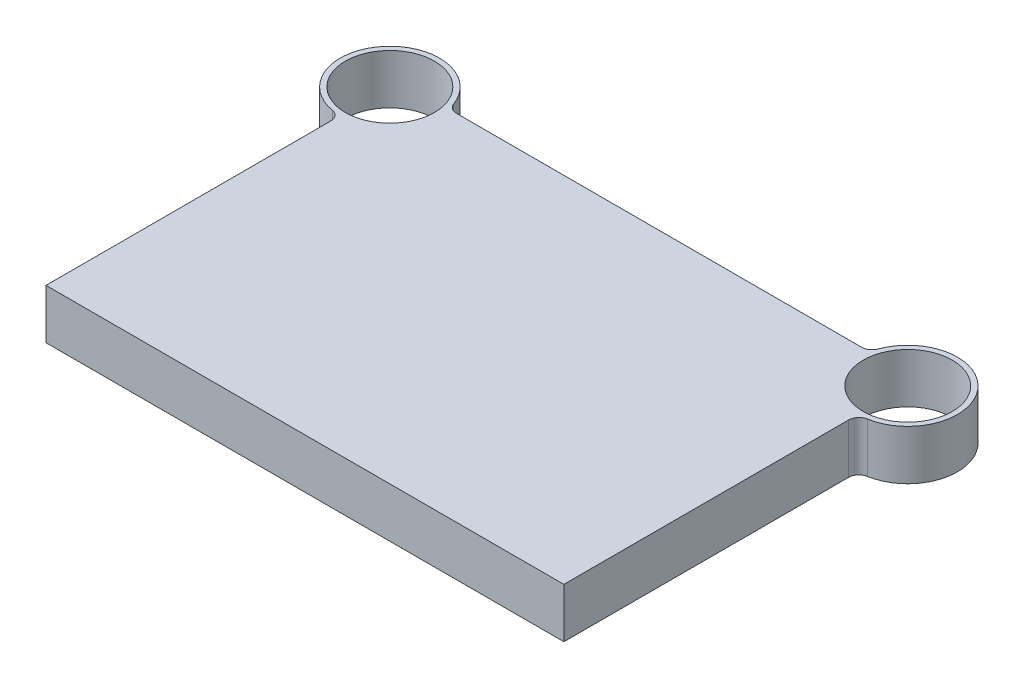
ISO-10303-21;
HEADER;
FILE_DESCRIPTION(('STEP AP214'),'2;1');
FILE_NAME('part.step','',(''),(''),'','','');
FILE_SCHEMA(('AUTOMOTIVE_DESIGN { 1 0 10303 214 1 1 1 1 }'));
ENDSEC;
DATA;
#1=APPLICATION_CONTEXT('core data for automotive mechanical design processes');
#2=APPLICATION_PROTOCOL_DEFINITION('international standard','automotive_design',2000,#1);
#3=PRODUCT_CONTEXT('',#1,'mechanical');
#4=PRODUCT('Part','Part','',(#3));
#5=PRODUCT_RELATED_PRODUCT_CATEGORY('part','',(#4));
#6=PRODUCT_DEFINITION_FORMATION('','',#4);
#7=PRODUCT_DEFINITION_CONTEXT('part definition',#1,'design');
#8=PRODUCT_DEFINITION('design','',#6,#7);
#9=PRODUCT_DEFINITION_SHAPE('','',#8);
#10=(LENGTH_UNIT() NAMED_UNIT(*) SI_UNIT(.MILLI.,.METRE.));
#11=(NAMED_UNIT(*) PLANE_ANGLE_UNIT() SI_UNIT($,.RADIAN.));
#12=(NAMED_UNIT(*) SI_UNIT($,.STERADIAN.) SOLID_ANGLE_UNIT());
#13=UNCERTAINTY_MEASURE_WITH_UNIT(LENGTH_MEASURE(1.E-05),#10,'distance_accuracy_value','');
#14=(GEOMETRIC_REPRESENTATION_CONTEXT(3) GLOBAL_UNCERTAINTY_ASSIGNED_CONTEXT((#13)) GLOBAL_UNIT_ASSIGNED_CONTEXT((#10,
#11,#12)) REPRESENTATION_CONTEXT('',''));
#15=CARTESIAN_POINT('',(0.,0.,0.));
#16=DIRECTION('',(0.,0.,1.));
#17=DIRECTION('',(1.,0.,0.));
#18=AXIS2_PLACEMENT_3D('',#15,#16,#17);
#19=CARTESIAN_POINT('',(-250.,48.,-332.));
#20=DIRECTION('',(0.,1.,0.));
#21=DIRECTION('',(0.,0.,1.));
#22=AXIS2_PLACEMENT_3D('',#19,#20,#21);
#23=PLANE('',#22);
#24=CARTESIAN_POINT('',(-250.,48.,-332.));
#25=DIRECTION('',(0.,1.,0.));
#26=DIRECTION('',(0.,0.,1.));
#27=AXIS2_PLACEMENT_3D('',#24,#25,#26);
#28=CIRCLE('',#27,43.);
#29=CARTESIAN_POINT('',(-250.,48.,-289.));
#30=VERTEX_POINT('',#29);
#31=EDGE_CURVE('E209',#30,#30,#28,.T.);
#32=ORIENTED_EDGE('',*,*,#31,.F.);
#33=EDGE_LOOP('',(#32));
#34=FACE_BOUND('',#33,.T.);
#35=CARTESIAN_POINT('',(-250.,48.,-332.));
#36=DIRECTION('',(0.,1.,0.));
#37=DIRECTION('',(0.,0.,1.));
#38=AXIS2_PLACEMENT_3D('',#35,#36,#37);
#39=CIRCLE('',#38,48.);
#40=CARTESIAN_POINT('',(-204.944030050815,48.,-348.551724137931));
#41=VERTEX_POINT('',#40);
#42=CARTESIAN_POINT('',(-258.275862068966,48.,-284.718818679992));
#43=VERTEX_POINT('',#42);
#44=EDGE_CURVE('E139',#41,#43,#39,.T.);
#45=ORIENTED_EDGE('',*,*,#44,.T.);
#46=CARTESIAN_POINT('',(-260.,48.,-274.868572571657));
#47=DIRECTION('',(0.,1.,0.));
#48=DIRECTION('',(0.,0.,1.));
#49=AXIS2_PLACEMENT_3D('',#46,#47,#48);
#50=CIRCLE('',#49,10.);
#51=CARTESIAN_POINT('',(-250.,48.,-274.868572571657));
#52=VERTEX_POINT('',#51);
#53=EDGE_CURVE('E116',#43,#52,#50,.F.);
#54=ORIENTED_EDGE('',*,*,#53,.T.);
#55=DIRECTION('',(0.,0.,1.));
#56=VECTOR('',#55,1.);
#57=CARTESIAN_POINT('',(-250.,48.,0.));
#58=LINE('',#57,#56);
#59=CARTESIAN_POINT('',(-250.,48.,0.));
#60=VERTEX_POINT('',#59);
#61=EDGE_CURVE('E109',#52,#60,#58,.T.);
#62=ORIENTED_EDGE('',*,*,#61,.T.);
#63=DIRECTION('',(1.,0.,0.));
#64=VECTOR('',#63,1.);
#65=CARTESIAN_POINT('',(250.,48.,0.));
#66=LINE('',#65,#64);
#67=CARTESIAN_POINT('',(250.,48.,0.));
#68=VERTEX_POINT('',#67);
#69=EDGE_CURVE('E113',#60,#68,#66,.T.);
#70=ORIENTED_EDGE('',*,*,#69,.T.);
#71=DIRECTION('',(0.,0.,-1.));
#72=VECTOR('',#71,1.);
#73=CARTESIAN_POINT('',(250.,48.,0.));
#74=LINE('',#73,#72);
#75=CARTESIAN_POINT('',(250.,48.,-274.868572571657));
#76=VERTEX_POINT('',#75);
#77=EDGE_CURVE('E129',#68,#76,#74,.T.);
#78=ORIENTED_EDGE('',*,*,#77,.T.);
#79=CARTESIAN_POINT('',(260.,48.,-274.868572571657));
#80=DIRECTION('',(0.,1.,0.));
#81=DIRECTION('',(0.,0.,1.));
#82=AXIS2_PLACEMENT_3D('',#79,#80,#81);
#83=CIRCLE('',#82,10.);
#84=CARTESIAN_POINT('',(258.275862068966,48.,-284.718818679992));
#85=VERTEX_POINT('',#84);
#86=EDGE_CURVE('E11',#76,#85,#83,.F.);
#87=ORIENTED_EDGE('',*,*,#86,.T.);
#88=CARTESIAN_POINT('',(250.,48.,-332.));
#89=DIRECTION('',(0.,1.,0.));
#90=DIRECTION('',(0.,0.,-1.));
#91=AXIS2_PLACEMENT_3D('',#88,#89,#90);
#92=CIRCLE('',#91,48.);
#93=CARTESIAN_POINT('',(204.944030050815,48.,-348.551724137931));
#94=VERTEX_POINT('',#93);
#95=EDGE_CURVE('E175',#85,#94,#92,.T.);
#96=ORIENTED_EDGE('',*,*,#95,.T.);
#97=CARTESIAN_POINT('',(195.557369644735,48.,-352.));
#98=DIRECTION('',(0.,1.,0.));
#99=DIRECTION('',(0.,0.,1.));
#100=AXIS2_PLACEMENT_3D('',#97,#98,#99);
#101=CIRCLE('',#100,10.);
#102=CARTESIAN_POINT('',(195.557369644735,48.,-342.));
#103=VERTEX_POINT('',#102);
#104=EDGE_CURVE('E167',#94,#103,#101,.F.);
#105=ORIENTED_EDGE('',*,*,#104,.T.);
#106=DIRECTION('',(-1.,0.,0.));
#107=VECTOR('',#106,1.);
#108=CARTESIAN_POINT('',(203.053221622778,48.,-342.));
#109=LINE('',#108,#107);
#110=CARTESIAN_POINT('',(-195.557369644735,48.,-342.));
#111=VERTEX_POINT('',#110);
#112=EDGE_CURVE('E172',#103,#111,#109,.T.);
#113=ORIENTED_EDGE('',*,*,#112,.T.);
#114=CARTESIAN_POINT('',(-195.557369644735,48.,-352.));
#115=DIRECTION('',(0.,1.,0.));
#116=DIRECTION('',(0.,0.,1.));
#117=AXIS2_PLACEMENT_3D('',#114,#115,#116);
#118=CIRCLE('',#117,10.);
#119=EDGE_CURVE('E163',#111,#41,#118,.F.);
#120=ORIENTED_EDGE('',*,*,#119,.T.);
#121=EDGE_LOOP('',(#45,#54,#62,#70,#78,#87,#96,#105,#113,#120));
#122=FACE_BOUND('',#121,.T.);
#123=CARTESIAN_POINT('',(250.,48.,-332.));
#124=DIRECTION('',(0.,1.,0.));
#125=DIRECTION('',(0.,0.,-1.));
#126=AXIS2_PLACEMENT_3D('',#123,#124,#125);
#127=CIRCLE('',#126,43.);
#128=CARTESIAN_POINT('',(250.,48.,-375.));
#129=VERTEX_POINT('',#128);
#130=EDGE_CURVE('E219',#129,#129,#127,.T.);
#131=ORIENTED_EDGE('',*,*,#130,.F.);
#132=EDGE_LOOP('',(#131));
#133=FACE_BOUND('',#132,.T.);
#134=ADVANCED_FACE('F33',(#34,#122,#133),#23,.T.);
#135=CARTESIAN_POINT('',(-250.,0.,-332.));
#136=DIRECTION('',(0.,1.,0.));
#137=DIRECTION('',(0.,0.,1.));
#138=AXIS2_PLACEMENT_3D('',#135,#136,#137);
#139=PLANE('',#138);
#140=DIRECTION('',(0.,0.,1.));
#141=VECTOR('',#140,1.);
#142=CARTESIAN_POINT('',(-250.,0.,0.));
#143=LINE('',#142,#141);
#144=CARTESIAN_POINT('',(-250.,0.,-274.868572571657));
#145=VERTEX_POINT('',#144);
#146=CARTESIAN_POINT('',(-250.,0.,0.));
#147=VERTEX_POINT('',#146);
#148=EDGE_CURVE('E133',#145,#147,#143,.T.);
#149=ORIENTED_EDGE('',*,*,#148,.F.);
#150=CARTESIAN_POINT('',(-260.,0.,-274.868572571657));
#151=DIRECTION('',(0.,1.,0.));
#152=DIRECTION('',(0.,0.,1.));
#153=AXIS2_PLACEMENT_3D('',#150,#151,#152);
#154=CIRCLE('',#153,10.);
#155=CARTESIAN_POINT('',(-258.275862068966,0.,-284.718818679992));
#156=VERTEX_POINT('',#155);
#157=EDGE_CURVE('E158',#145,#156,#154,.T.);
#158=ORIENTED_EDGE('',*,*,#157,.T.);
#159=CARTESIAN_POINT('',(-250.,0.,-332.));
#160=DIRECTION('',(0.,1.,0.));
#161=DIRECTION('',(0.,0.,1.));
#162=AXIS2_PLACEMENT_3D('',#159,#160,#161);
#163=CIRCLE('',#162,48.);
#164=CARTESIAN_POINT('',(-204.944030050815,0.,-348.551724137931));
#165=VERTEX_POINT('',#164);
#166=EDGE_CURVE('E121',#165,#156,#163,.T.);
#167=ORIENTED_EDGE('',*,*,#166,.F.);
#168=CARTESIAN_POINT('',(-195.557369644735,0.,-352.));
#169=DIRECTION('',(0.,1.,0.));
#170=DIRECTION('',(0.,0.,1.));
#171=AXIS2_PLACEMENT_3D('',#168,#169,#170);
#172=CIRCLE('',#171,10.);
#173=CARTESIAN_POINT('',(-195.557369644735,0.,-342.));
#174=VERTEX_POINT('',#173);
#175=EDGE_CURVE('E161',#165,#174,#172,.T.);
#176=ORIENTED_EDGE('',*,*,#175,.T.);
#177=DIRECTION('',(-1.,0.,0.));
#178=VECTOR('',#177,1.);
#179=CARTESIAN_POINT('',(203.053221622778,0.,-342.));
#180=LINE('',#179,#178);
#181=CARTESIAN_POINT('',(195.557369644735,0.,-342.));
#182=VERTEX_POINT('',#181);
#183=EDGE_CURVE('E190',#182,#174,#180,.T.);
#184=ORIENTED_EDGE('',*,*,#183,.F.);
#185=CARTESIAN_POINT('',(195.557369644735,0.,-352.));
#186=DIRECTION('',(0.,1.,0.));
#187=DIRECTION('',(0.,0.,1.));
#188=AXIS2_PLACEMENT_3D('',#185,#186,#187);
#189=CIRCLE('',#188,10.);
#190=CARTESIAN_POINT('',(204.944030050815,0.,-348.551724137931));
#191=VERTEX_POINT('',#190);
#192=EDGE_CURVE('E165',#182,#191,#189,.T.);
#193=ORIENTED_EDGE('',*,*,#192,.T.);
#194=CARTESIAN_POINT('',(250.,0.,-332.));
#195=DIRECTION('',(0.,1.,0.));
#196=DIRECTION('',(0.,0.,-1.));
#197=AXIS2_PLACEMENT_3D('',#194,#195,#196);
#198=CIRCLE('',#197,48.);
#199=CARTESIAN_POINT('',(258.275862068966,0.,-284.718818679992));
#200=VERTEX_POINT('',#199);
#201=EDGE_CURVE('E189',#200,#191,#198,.T.);
#202=ORIENTED_EDGE('',*,*,#201,.F.);
#203=CARTESIAN_POINT('',(260.,0.,-274.868572571657));
#204=DIRECTION('',(0.,1.,0.));
#205=DIRECTION('',(0.,0.,1.));
#206=AXIS2_PLACEMENT_3D('',#203,#204,#205);
#207=CIRCLE('',#206,10.);
#208=CARTESIAN_POINT('',(250.,0.,-274.868572571657));
#209=VERTEX_POINT('',#208);
#210=EDGE_CURVE('E41',#200,#209,#207,.T.);
#211=ORIENTED_EDGE('',*,*,#210,.T.);
#212=DIRECTION('',(0.,0.,-1.));
#213=VECTOR('',#212,1.);
#214=CARTESIAN_POINT('',(250.,0.,0.));
#215=LINE('',#214,#213);
#216=CARTESIAN_POINT('',(250.,0.,0.));
#217=VERTEX_POINT('',#216);
#218=EDGE_CURVE('E194',#217,#209,#215,.T.);
#219=ORIENTED_EDGE('',*,*,#218,.F.);
#220=DIRECTION('',(1.,0.,0.));
#221=VECTOR('',#220,1.);
#222=CARTESIAN_POINT('',(250.,0.,0.));
#223=LINE('',#222,#221);
#224=EDGE_CURVE('E197',#147,#217,#223,.T.);
#225=ORIENTED_EDGE('',*,*,#224,.F.);
#226=EDGE_LOOP('',(#149,#158,#167,#176,#184,#193,#202,#211,#219,#225));
#227=FACE_BOUND('',#226,.T.);
#228=CARTESIAN_POINT('',(-250.,0.,-332.));
#229=DIRECTION('',(0.,1.,0.));
#230=DIRECTION('',(0.,0.,1.));
#231=AXIS2_PLACEMENT_3D('',#228,#229,#230);
#232=CIRCLE('',#231,43.);
#233=CARTESIAN_POINT('',(-250.,0.,-289.));
#234=VERTEX_POINT('',#233);
#235=EDGE_CURVE('E212',#234,#234,#232,.T.);
#236=ORIENTED_EDGE('',*,*,#235,.T.);
#237=EDGE_LOOP('',(#236));
#238=FACE_BOUND('',#237,.T.);
#239=CARTESIAN_POINT('',(250.,0.,-332.));
#240=DIRECTION('',(0.,1.,0.));
#241=DIRECTION('',(0.,0.,-1.));
#242=AXIS2_PLACEMENT_3D('',#239,#240,#241);
#243=CIRCLE('',#242,43.);
#244=CARTESIAN_POINT('',(250.,0.,-375.));
#245=VERTEX_POINT('',#244);
#246=EDGE_CURVE('E221',#245,#245,#243,.T.);
#247=ORIENTED_EDGE('',*,*,#246,.T.);
#248=EDGE_LOOP('',(#247));
#249=FACE_BOUND('',#248,.T.);
#250=ADVANCED_FACE('F187',(#227,#238,#249),#139,.F.);
#251=CARTESIAN_POINT('',(-250.,48.,0.));
#252=DIRECTION('',(1.,0.,0.));
#253=DIRECTION('',(0.,0.,-1.));
#254=AXIS2_PLACEMENT_3D('',#251,#252,#253);
#255=PLANE('',#254);
#256=ORIENTED_EDGE('',*,*,#61,.F.);
#257=DIRECTION('',(0.,1.,0.));
#258=VECTOR('',#257,1.);
#259=CARTESIAN_POINT('',(-250.,0.,-274.868572571657));
#260=LINE('',#259,#258);
#261=EDGE_CURVE('E135',#52,#145,#260,.F.);
#262=ORIENTED_EDGE('',*,*,#261,.T.);
#263=ORIENTED_EDGE('',*,*,#148,.T.);
#264=DIRECTION('',(0.,-1.,0.));
#265=VECTOR('',#264,1.);
#266=CARTESIAN_POINT('',(-250.,48.,0.));
#267=LINE('',#266,#265);
#268=EDGE_CURVE('E126',#60,#147,#267,.T.);
#269=ORIENTED_EDGE('',*,*,#268,.F.);
#270=EDGE_LOOP('',(#256,#262,#263,#269));
#271=FACE_BOUND('',#270,.T.);
#272=ADVANCED_FACE('F131',(#271),#255,.F.);
#273=CARTESIAN_POINT('',(250.,48.,0.));
#274=DIRECTION('',(0.,0.,-1.));
#275=DIRECTION('',(-1.,0.,0.));
#276=AXIS2_PLACEMENT_3D('',#273,#274,#275);
#277=PLANE('',#276);
#278=ORIENTED_EDGE('',*,*,#224,.T.);
#279=DIRECTION('',(0.,-1.,0.));
#280=VECTOR('',#279,1.);
#281=CARTESIAN_POINT('',(250.,48.,0.));
#282=LINE('',#281,#280);
#283=EDGE_CURVE('E128',#68,#217,#282,.T.);
#284=ORIENTED_EDGE('',*,*,#283,.F.);
#285=ORIENTED_EDGE('',*,*,#69,.F.);
#286=ORIENTED_EDGE('',*,*,#268,.T.);
#287=EDGE_LOOP('',(#278,#284,#285,#286));
#288=FACE_BOUND('',#287,.T.);
#289=ADVANCED_FACE('F125',(#288),#277,.F.);
#290=CARTESIAN_POINT('',(250.,48.,0.));
#291=DIRECTION('',(-1.,0.,0.));
#292=DIRECTION('',(0.,0.,1.));
#293=AXIS2_PLACEMENT_3D('',#290,#291,#292);
#294=PLANE('',#293);
#295=ORIENTED_EDGE('',*,*,#218,.T.);
#296=DIRECTION('',(0.,1.,0.));
#297=VECTOR('',#296,1.);
#298=CARTESIAN_POINT('',(250.,48.,-274.868572571657));
#299=LINE('',#298,#297);
#300=EDGE_CURVE('E48',#209,#76,#299,.T.);
#301=ORIENTED_EDGE('',*,*,#300,.T.);
#302=ORIENTED_EDGE('',*,*,#77,.F.);
#303=ORIENTED_EDGE('',*,*,#283,.T.);
#304=EDGE_LOOP('',(#295,#301,#302,#303));
#305=FACE_BOUND('',#304,.T.);
#306=ADVANCED_FACE('F247',(#305),#294,.F.);
#307=CARTESIAN_POINT('',(250.,48.,-332.));
#308=DIRECTION('',(0.,-1.,0.));
#309=DIRECTION('',(0.,0.,-1.));
#310=AXIS2_PLACEMENT_3D('',#307,#308,#309);
#311=CYLINDRICAL_SURFACE('',#310,48.);
#312=ORIENTED_EDGE('',*,*,#201,.T.);
#313=DIRECTION('',(0.,-1.,0.));
#314=VECTOR('',#313,1.);
#315=CARTESIAN_POINT('',(204.944030050815,48.,-348.551724137931));
#316=LINE('',#315,#314);
#317=EDGE_CURVE('E155',#191,#94,#316,.F.);
#318=ORIENTED_EDGE('',*,*,#317,.T.);
#319=ORIENTED_EDGE('',*,*,#95,.F.);
#320=DIRECTION('',(0.,-1.,0.));
#321=VECTOR('',#320,1.);
#322=CARTESIAN_POINT('',(258.275862068966,48.,-284.718818679992));
#323=LINE('',#322,#321);
#324=EDGE_CURVE('E152',#85,#200,#323,.T.);
#325=ORIENTED_EDGE('',*,*,#324,.T.);
#326=EDGE_LOOP('',(#312,#318,#319,#325));
#327=FACE_BOUND('',#326,.T.);
#328=ADVANCED_FACE('F192',(#327),#311,.T.);
#329=CARTESIAN_POINT('',(203.053221622778,48.,-342.));
#330=DIRECTION('',(0.,0.,1.));
#331=DIRECTION('',(1.,0.,0.));
#332=AXIS2_PLACEMENT_3D('',#329,#330,#331);
#333=PLANE('',#332);
#334=ORIENTED_EDGE('',*,*,#183,.T.);
#335=DIRECTION('',(0.,1.,0.));
#336=VECTOR('',#335,1.);
#337=CARTESIAN_POINT('',(-195.557369644735,48.,-342.));
#338=LINE('',#337,#336);
#339=EDGE_CURVE('E150',#174,#111,#338,.T.);
#340=ORIENTED_EDGE('',*,*,#339,.T.);
#341=ORIENTED_EDGE('',*,*,#112,.F.);
#342=DIRECTION('',(0.,1.,0.));
#343=VECTOR('',#342,1.);
#344=CARTESIAN_POINT('',(195.557369644735,0.,-342.));
#345=LINE('',#344,#343);
#346=EDGE_CURVE('E147',#103,#182,#345,.F.);
#347=ORIENTED_EDGE('',*,*,#346,.T.);
#348=EDGE_LOOP('',(#334,#340,#341,#347));
#349=FACE_BOUND('',#348,.T.);
#350=ADVANCED_FACE('F181',(#349),#333,.F.);
#351=CARTESIAN_POINT('',(-250.,48.,-332.));
#352=DIRECTION('',(0.,-1.,0.));
#353=DIRECTION('',(0.,0.,-1.));
#354=AXIS2_PLACEMENT_3D('',#351,#352,#353);
#355=CYLINDRICAL_SURFACE('',#354,48.);
#356=ORIENTED_EDGE('',*,*,#166,.T.);
#357=DIRECTION('',(0.,-1.,0.));
#358=VECTOR('',#357,1.);
#359=CARTESIAN_POINT('',(-258.275862068966,48.,-284.718818679992));
#360=LINE('',#359,#358);
#361=EDGE_CURVE('E145',#156,#43,#360,.F.);
#362=ORIENTED_EDGE('',*,*,#361,.T.);
#363=ORIENTED_EDGE('',*,*,#44,.F.);
#364=DIRECTION('',(0.,-1.,0.));
#365=VECTOR('',#364,1.);
#366=CARTESIAN_POINT('',(-204.944030050815,48.,-348.551724137931));
#367=LINE('',#366,#365);
#368=EDGE_CURVE('E137',#41,#165,#367,.T.);
#369=ORIENTED_EDGE('',*,*,#368,.T.);
#370=EDGE_LOOP('',(#356,#362,#363,#369));
#371=FACE_BOUND('',#370,.T.);
#372=ADVANCED_FACE('F204',(#371),#355,.T.);
#373=CARTESIAN_POINT('',(-250.,48.,-332.));
#374=DIRECTION('',(0.,-1.,0.));
#375=DIRECTION('',(0.,0.,-1.));
#376=AXIS2_PLACEMENT_3D('',#373,#374,#375);
#377=CYLINDRICAL_SURFACE('',#376,43.);
#378=ORIENTED_EDGE('',*,*,#31,.T.);
#379=EDGE_LOOP('',(#378));
#380=FACE_BOUND('',#379,.T.);
#381=ORIENTED_EDGE('',*,*,#235,.F.);
#382=EDGE_LOOP('',(#381));
#383=FACE_BOUND('',#382,.T.);
#384=ADVANCED_FACE('F238',(#380,#383),#377,.F.);
#385=CARTESIAN_POINT('',(250.,48.,-332.));
#386=DIRECTION('',(0.,-1.,0.));
#387=DIRECTION('',(0.,0.,-1.));
#388=AXIS2_PLACEMENT_3D('',#385,#386,#387);
#389=CYLINDRICAL_SURFACE('',#388,43.);
#390=ORIENTED_EDGE('',*,*,#130,.T.);
#391=EDGE_LOOP('',(#390));
#392=FACE_BOUND('',#391,.T.);
#393=ORIENTED_EDGE('',*,*,#246,.F.);
#394=EDGE_LOOP('',(#393));
#395=FACE_BOUND('',#394,.T.);
#396=ADVANCED_FACE('F227',(#392,#395),#389,.F.);
#397=CARTESIAN_POINT('',(-260.,48.,-274.868572571657));
#398=DIRECTION('',(0.,-1.,0.));
#399=DIRECTION('',(0.,0.,-1.));
#400=AXIS2_PLACEMENT_3D('',#397,#398,#399);
#401=CYLINDRICAL_SURFACE('',#400,10.);
#402=ORIENTED_EDGE('',*,*,#53,.F.);
#403=ORIENTED_EDGE('',*,*,#361,.F.);
#404=ORIENTED_EDGE('',*,*,#157,.F.);
#405=ORIENTED_EDGE('',*,*,#261,.F.);
#406=EDGE_LOOP('',(#402,#403,#404,#405));
#407=FACE_BOUND('',#406,.T.);
#408=ADVANCED_FACE('F208',(#407),#401,.F.);
#409=CARTESIAN_POINT('',(-195.557369644735,48.,-352.));
#410=DIRECTION('',(0.,-1.,0.));
#411=DIRECTION('',(0.,0.,-1.));
#412=AXIS2_PLACEMENT_3D('',#409,#410,#411);
#413=CYLINDRICAL_SURFACE('',#412,10.);
#414=ORIENTED_EDGE('',*,*,#119,.F.);
#415=ORIENTED_EDGE('',*,*,#339,.F.);
#416=ORIENTED_EDGE('',*,*,#175,.F.);
#417=ORIENTED_EDGE('',*,*,#368,.F.);
#418=EDGE_LOOP('',(#414,#415,#416,#417));
#419=FACE_BOUND('',#418,.T.);
#420=ADVANCED_FACE('F256',(#419),#413,.F.);
#421=CARTESIAN_POINT('',(195.557369644735,48.,-352.));
#422=DIRECTION('',(0.,-1.,0.));
#423=DIRECTION('',(0.,0.,-1.));
#424=AXIS2_PLACEMENT_3D('',#421,#422,#423);
#425=CYLINDRICAL_SURFACE('',#424,10.);
#426=ORIENTED_EDGE('',*,*,#104,.F.);
#427=ORIENTED_EDGE('',*,*,#317,.F.);
#428=ORIENTED_EDGE('',*,*,#192,.F.);
#429=ORIENTED_EDGE('',*,*,#346,.F.);
#430=EDGE_LOOP('',(#426,#427,#428,#429));
#431=FACE_BOUND('',#430,.T.);
#432=ADVANCED_FACE('F185',(#431),#425,.F.);
#433=CARTESIAN_POINT('',(260.,48.,-274.868572571657));
#434=DIRECTION('',(0.,-1.,0.));
#435=DIRECTION('',(0.,0.,-1.));
#436=AXIS2_PLACEMENT_3D('',#433,#434,#435);
#437=CYLINDRICAL_SURFACE('',#436,10.);
#438=ORIENTED_EDGE('',*,*,#86,.F.);
#439=ORIENTED_EDGE('',*,*,#300,.F.);
#440=ORIENTED_EDGE('',*,*,#210,.F.);
#441=ORIENTED_EDGE('',*,*,#324,.F.);
#442=EDGE_LOOP('',(#438,#439,#440,#441));
#443=FACE_BOUND('',#442,.T.);
#444=ADVANCED_FACE('F35',(#443),#437,.F.);
#445=CLOSED_SHELL('',(#134,#250,#272,#289,#306,#328,#350,#372,#384,#396,#408,#420,#432,#444));
#446=MANIFOLD_SOLID_BREP('B2',#445);
#447=ADVANCED_BREP_SHAPE_REPRESENTATION('',(#18,#446),#14);
#448=SHAPE_DEFINITION_REPRESENTATION(#9,#447);
ENDSEC;
END-ISO-10303-21;
